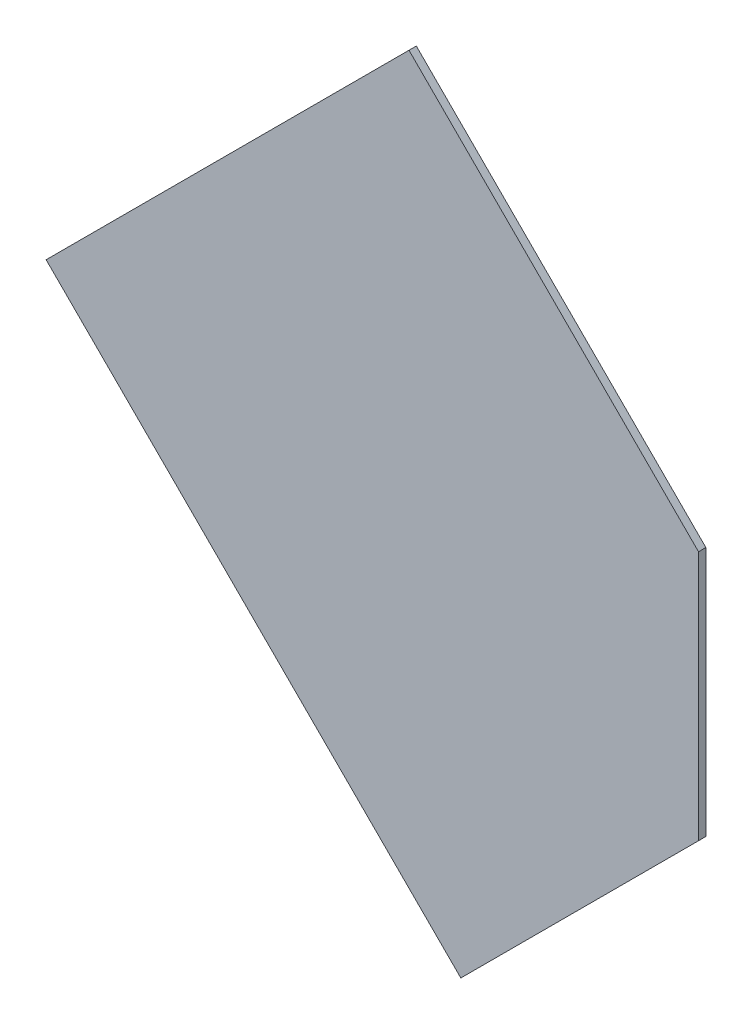
ISO-10303-21;
HEADER;
FILE_DESCRIPTION(('STEP AP214'),'2;1');
FILE_NAME('part.step','',(''),(''),'','','');
FILE_SCHEMA(('AUTOMOTIVE_DESIGN { 1 0 10303 214 1 1 1 1 }'));
ENDSEC;
DATA;
#1=APPLICATION_CONTEXT('core data for automotive mechanical design processes');
#2=APPLICATION_PROTOCOL_DEFINITION('international standard','automotive_design',2000,#1);
#3=PRODUCT_CONTEXT('',#1,'mechanical');
#4=PRODUCT('Part','Part','',(#3));
#5=PRODUCT_RELATED_PRODUCT_CATEGORY('part','',(#4));
#6=PRODUCT_DEFINITION_FORMATION('','',#4);
#7=PRODUCT_DEFINITION_CONTEXT('part definition',#1,'design');
#8=PRODUCT_DEFINITION('design','',#6,#7);
#9=PRODUCT_DEFINITION_SHAPE('','',#8);
#10=(LENGTH_UNIT() NAMED_UNIT(*) SI_UNIT(.MILLI.,.METRE.));
#11=(NAMED_UNIT(*) PLANE_ANGLE_UNIT() SI_UNIT($,.RADIAN.));
#12=(NAMED_UNIT(*) SI_UNIT($,.STERADIAN.) SOLID_ANGLE_UNIT());
#13=UNCERTAINTY_MEASURE_WITH_UNIT(LENGTH_MEASURE(1.E-05),#10,'distance_accuracy_value','');
#14=(GEOMETRIC_REPRESENTATION_CONTEXT(3) GLOBAL_UNCERTAINTY_ASSIGNED_CONTEXT((#13)) GLOBAL_UNIT_ASSIGNED_CONTEXT((#10,
#11,#12)) REPRESENTATION_CONTEXT('',''));
#15=CARTESIAN_POINT('',(0.,0.,0.));
#16=DIRECTION('',(0.,0.,1.));
#17=DIRECTION('',(1.,0.,0.));
#18=AXIS2_PLACEMENT_3D('',#15,#16,#17);
#19=CARTESIAN_POINT('',(9.899999999999,7.928329999999,0.80916));
#20=DIRECTION('',(1.450297221417E-10,1.450297221417E-10,-1.));
#21=DIRECTION('',(-1.,0.,-1.450297221417E-10));
#22=AXIS2_PLACEMENT_3D('',#19,#20,#21);
#23=PLANE('',#22);
#24=DIRECTION('',(-0.707106781186548,-0.707106781186548,0.));
#25=VECTOR('',#24,1.);
#26=CARTESIAN_POINT('',(8.591852454803,7.610131948465,0.809159999764));
#27=LINE('',#26,#25);
#28=CARTESIAN_POINT('',(8.59185245480338,7.61013194846537,0.809159999764033));
#29=VERTEX_POINT('',#28);
#30=CARTESIAN_POINT('',(8.916116523515,7.93439601717725,0.809159999834594));
#31=VERTEX_POINT('',#30);
#32=EDGE_CURVE('E91',#29,#31,#27,.F.);
#33=ORIENTED_EDGE('',*,*,#32,.T.);
#34=DIRECTION('',(0.,1.,0.));
#35=VECTOR('',#34,1.);
#36=CARTESIAN_POINT('',(8.916116523515,8.275817373414,0.809159999858));
#37=LINE('',#36,#35);
#38=CARTESIAN_POINT('',(8.91611652351513,8.27581737341388,0.809159999895352));
#39=VERTEX_POINT('',#38);
#40=EDGE_CURVE('E86',#31,#39,#37,.T.);
#41=ORIENTED_EDGE('',*,*,#40,.T.);
#42=DIRECTION('',(0.707106781186548,-0.707106781186548,0.));
#43=VECTOR('',#42,1.);
#44=CARTESIAN_POINT('',(8.916116523515,8.275817373414,0.809159999908));
#45=LINE('',#44,#43);
#46=CARTESIAN_POINT('',(8.52114177668525,8.6707921202445,0.809159999907852));
#47=VERTEX_POINT('',#46);
#48=EDGE_CURVE('E62',#39,#47,#45,.F.);
#49=ORIENTED_EDGE('',*,*,#48,.T.);
#50=DIRECTION('',(0.707106781186548,0.707106781186548,0.));
#51=VECTOR('',#50,1.);
#52=CARTESIAN_POINT('',(8.026167029854,8.175817373414,0.809159999908));
#53=LINE('',#52,#51);
#54=CARTESIAN_POINT('',(8.02616702985413,8.17581737341387,0.809159999800066));
#55=VERTEX_POINT('',#54);
#56=EDGE_CURVE('E64',#47,#55,#53,.F.);
#57=ORIENTED_EDGE('',*,*,#56,.T.);
#58=DIRECTION('',(-0.707106781186548,0.707106781186548,0.));
#59=VECTOR('',#58,1.);
#60=CARTESIAN_POINT('',(8.591852454803,7.610131948465,0.809159999764));
#61=LINE('',#60,#59);
#62=EDGE_CURVE('E20',#55,#29,#61,.F.);
#63=ORIENTED_EDGE('',*,*,#62,.T.);
#64=EDGE_LOOP('',(#33,#41,#49,#57,#63));
#65=FACE_BOUND('',#64,.T.);
#66=ADVANCED_FACE('F17',(#65),#23,.F.);
#67=CARTESIAN_POINT('',(8.591852454803,7.610131948465,0.809159999764));
#68=DIRECTION('',(0.707106781186548,0.707106781186548,2.05102999999869E-10));
#69=DIRECTION('',(-0.707106781186548,0.707106781186548,0.));
#70=AXIS2_PLACEMENT_3D('',#67,#68,#69);
#71=PLANE('',#70);
#72=DIRECTION('',(0.,0.,1.));
#73=VECTOR('',#72,1.);
#74=CARTESIAN_POINT('',(8.5918524548045,7.6101319484665,0.809159999764));
#75=LINE('',#74,#73);
#76=CARTESIAN_POINT('',(8.5918524548046,7.61013194846635,0.799159999787533));
#77=VERTEX_POINT('',#76);
#78=EDGE_CURVE('E75',#77,#29,#75,.T.);
#79=ORIENTED_EDGE('',*,*,#78,.T.);
#80=ORIENTED_EDGE('',*,*,#62,.F.);
#81=DIRECTION('',(0.,0.,1.));
#82=VECTOR('',#81,1.);
#83=CARTESIAN_POINT('',(8.026167029854,8.175817373414,0.809159999764));
#84=LINE('',#83,#82);
#85=CARTESIAN_POINT('',(8.02616702985548,8.17581737341473,0.799159999764033));
#86=VERTEX_POINT('',#85);
#87=EDGE_CURVE('E70',#55,#86,#84,.F.);
#88=ORIENTED_EDGE('',*,*,#87,.T.);
#89=DIRECTION('',(-0.707106781186547,0.707106781186548,0.));
#90=VECTOR('',#89,1.);
#91=CARTESIAN_POINT('',(8.591852454805,7.610131948466,0.799159999764132));
#92=LINE('',#91,#90);
#93=EDGE_CURVE('E94',#77,#86,#92,.T.);
#94=ORIENTED_EDGE('',*,*,#93,.F.);
#95=EDGE_LOOP('',(#79,#80,#88,#94));
#96=FACE_BOUND('',#95,.T.);
#97=ADVANCED_FACE('F72',(#96),#71,.F.);
#98=CARTESIAN_POINT('',(8.026167029854,8.175817373414,0.809159999764));
#99=DIRECTION('',(0.707106781186548,-0.707106781186548,0.));
#100=DIRECTION('',(0.707106781186548,0.707106781186548,0.));
#101=AXIS2_PLACEMENT_3D('',#98,#99,#100);
#102=PLANE('',#101);
#103=ORIENTED_EDGE('',*,*,#87,.F.);
#104=ORIENTED_EDGE('',*,*,#56,.F.);
#105=DIRECTION('',(-1.45029722141612E-10,-1.45029722141612E-10,1.));
#106=VECTOR('',#105,1.);
#107=CARTESIAN_POINT('',(8.521141776685,8.670792120244,0.809159999908));
#108=LINE('',#107,#106);
#109=CARTESIAN_POINT('',(8.52114177668611,8.67079212024586,0.799159999835926));
#110=VERTEX_POINT('',#109);
#111=EDGE_CURVE('E82',#47,#110,#108,.F.);
#112=ORIENTED_EDGE('',*,*,#111,.T.);
#113=DIRECTION('',(0.707106781185832,0.707106781187262,2.05102861777807E-10));
#114=VECTOR('',#113,1.);
#115=CARTESIAN_POINT('',(8.026167029856,8.175817373415,0.799159999764132));
#116=LINE('',#115,#114);
#117=EDGE_CURVE('E79',#86,#110,#116,.T.);
#118=ORIENTED_EDGE('',*,*,#117,.F.);
#119=EDGE_LOOP('',(#103,#104,#112,#118));
#120=FACE_BOUND('',#119,.T.);
#121=ADVANCED_FACE('F77',(#120),#102,.F.);
#122=CARTESIAN_POINT('',(8.916116523515,8.275817373414,0.809159999908));
#123=DIRECTION('',(-0.707106781186548,-0.707106781186548,-2.05102999999869E-10));
#124=DIRECTION('',(0.707106781186548,-0.707106781186548,0.));
#125=AXIS2_PLACEMENT_3D('',#122,#123,#124);
#126=PLANE('',#125);
#127=ORIENTED_EDGE('',*,*,#111,.F.);
#128=ORIENTED_EDGE('',*,*,#48,.F.);
#129=DIRECTION('',(-1.450297221417E-10,0.,1.));
#130=VECTOR('',#129,1.);
#131=CARTESIAN_POINT('',(8.916116523515,8.275817373414,0.809159999908));
#132=LINE('',#131,#130);
#133=CARTESIAN_POINT('',(8.91611652351684,8.27581737341472,0.799159999907926));
#134=VERTEX_POINT('',#133);
#135=EDGE_CURVE('E88',#39,#134,#132,.F.);
#136=ORIENTED_EDGE('',*,*,#135,.T.);
#137=DIRECTION('',(0.707106781186546,-0.707106781186549,0.));
#138=VECTOR('',#137,1.);
#139=CARTESIAN_POINT('',(8.521141776686,8.670792120246,0.799159999907704));
#140=LINE('',#139,#138);
#141=EDGE_CURVE('E97',#110,#134,#140,.T.);
#142=ORIENTED_EDGE('',*,*,#141,.F.);
#143=EDGE_LOOP('',(#127,#128,#136,#142));
#144=FACE_BOUND('',#143,.T.);
#145=ADVANCED_FACE('F107',(#144),#126,.F.);
#146=CARTESIAN_POINT('',(8.916116523515,8.275817373414,0.809159999908));
#147=DIRECTION('',(-1.,0.,-1.450297221417E-10));
#148=DIRECTION('',(-1.450297221417E-10,0.,1.));
#149=AXIS2_PLACEMENT_3D('',#146,#147,#148);
#150=PLANE('',#149);
#151=ORIENTED_EDGE('',*,*,#135,.F.);
#152=ORIENTED_EDGE('',*,*,#40,.F.);
#153=DIRECTION('',(0.,0.,1.));
#154=VECTOR('',#153,1.);
#155=CARTESIAN_POINT('',(8.916116523515,7.934396017177,0.809159999764));
#156=LINE('',#155,#154);
#157=CARTESIAN_POINT('',(8.91611652351622,7.93439601717775,0.799159999883047));
#158=VERTEX_POINT('',#157);
#159=EDGE_CURVE('E35',#31,#158,#156,.F.);
#160=ORIENTED_EDGE('',*,*,#159,.T.);
#161=DIRECTION('',(0.,1.,1.450297221417E-10));
#162=VECTOR('',#161,1.);
#163=CARTESIAN_POINT('',(8.916116523517,7.92833,0.799159999857308));
#164=LINE('',#163,#162);
#165=EDGE_CURVE('E26',#134,#158,#164,.F.);
#166=ORIENTED_EDGE('',*,*,#165,.F.);
#167=EDGE_LOOP('',(#151,#152,#160,#166));
#168=FACE_BOUND('',#167,.T.);
#169=ADVANCED_FACE('F105',(#168),#150,.F.);
#170=CARTESIAN_POINT('',(8.591852454803,7.610131948465,0.809159999764));
#171=DIRECTION('',(-0.707106781186548,0.707106781186548,0.));
#172=DIRECTION('',(-0.707106781186548,-0.707106781186548,0.));
#173=AXIS2_PLACEMENT_3D('',#170,#171,#172);
#174=PLANE('',#173);
#175=ORIENTED_EDGE('',*,*,#159,.F.);
#176=ORIENTED_EDGE('',*,*,#32,.F.);
#177=ORIENTED_EDGE('',*,*,#78,.F.);
#178=DIRECTION('',(-0.707106781186547,-0.707106781186548,-2.05102964965758E-10));
#179=VECTOR('',#178,1.);
#180=CARTESIAN_POINT('',(8.916116523517,7.934396017178,0.799159999858187));
#181=LINE('',#180,#179);
#182=EDGE_CURVE('E11',#158,#77,#181,.T.);
#183=ORIENTED_EDGE('',*,*,#182,.F.);
#184=EDGE_LOOP('',(#175,#176,#177,#183));
#185=FACE_BOUND('',#184,.T.);
#186=ADVANCED_FACE('F109',(#185),#174,.F.);
#187=CARTESIAN_POINT('',(9.9,7.92833,0.79916));
#188=DIRECTION('',(1.450297221417E-10,1.450297221417E-10,-1.));
#189=DIRECTION('',(-1.,0.,-1.450297221417E-10));
#190=AXIS2_PLACEMENT_3D('',#187,#188,#189);
#191=PLANE('',#190);
#192=ORIENTED_EDGE('',*,*,#165,.T.);
#193=ORIENTED_EDGE('',*,*,#182,.T.);
#194=ORIENTED_EDGE('',*,*,#93,.T.);
#195=ORIENTED_EDGE('',*,*,#117,.T.);
#196=ORIENTED_EDGE('',*,*,#141,.T.);
#197=EDGE_LOOP('',(#192,#193,#194,#195,#196));
#198=FACE_BOUND('',#197,.T.);
#199=ADVANCED_FACE('F102',(#198),#191,.T.);
#200=CLOSED_SHELL('',(#66,#97,#121,#145,#169,#186,#199));
#201=MANIFOLD_SOLID_BREP('B1',#200);
#202=ADVANCED_BREP_SHAPE_REPRESENTATION('',(#18,#201),#14);
#203=SHAPE_DEFINITION_REPRESENTATION(#9,#202);
ENDSEC;
END-ISO-10303-21;
